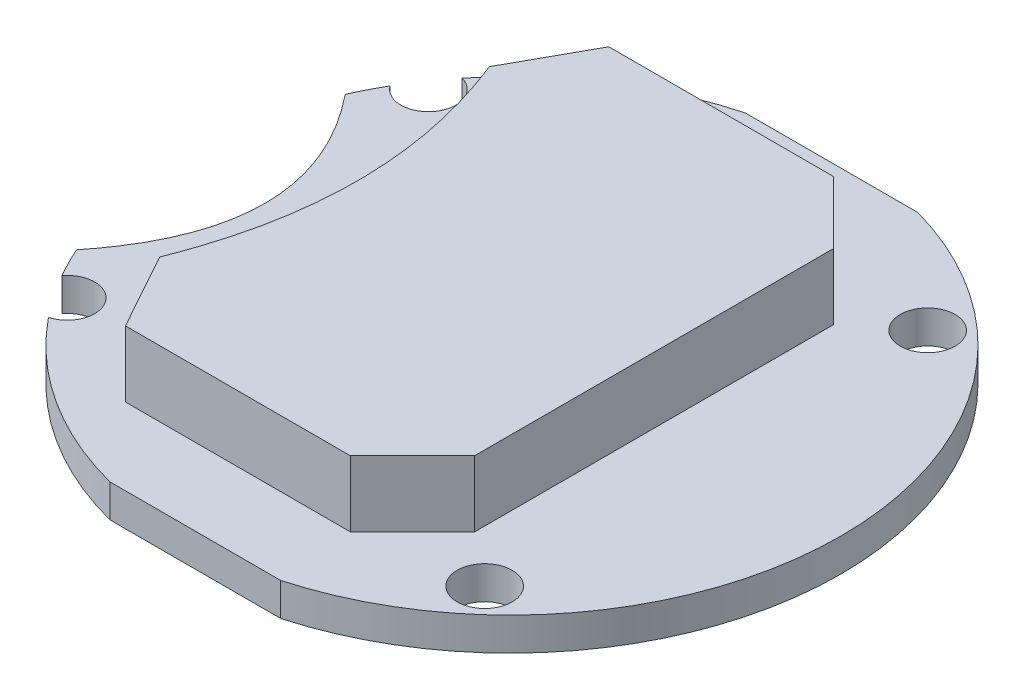
ISO-10303-21;
HEADER;
FILE_DESCRIPTION(('STEP AP214'),'2;1');
FILE_NAME('part.step','',(''),(''),'','','');
FILE_SCHEMA(('AUTOMOTIVE_DESIGN { 1 0 10303 214 1 1 1 1 }'));
ENDSEC;
DATA;
#1=APPLICATION_CONTEXT('core data for automotive mechanical design processes');
#2=APPLICATION_PROTOCOL_DEFINITION('international standard','automotive_design',2000,#1);
#3=PRODUCT_CONTEXT('',#1,'mechanical');
#4=PRODUCT('Part','Part','',(#3));
#5=PRODUCT_RELATED_PRODUCT_CATEGORY('part','',(#4));
#6=PRODUCT_DEFINITION_FORMATION('','',#4);
#7=PRODUCT_DEFINITION_CONTEXT('part definition',#1,'design');
#8=PRODUCT_DEFINITION('design','',#6,#7);
#9=PRODUCT_DEFINITION_SHAPE('','',#8);
#10=(LENGTH_UNIT() NAMED_UNIT(*) SI_UNIT(.MILLI.,.METRE.));
#11=(NAMED_UNIT(*) PLANE_ANGLE_UNIT() SI_UNIT($,.RADIAN.));
#12=(NAMED_UNIT(*) SI_UNIT($,.STERADIAN.) SOLID_ANGLE_UNIT());
#13=UNCERTAINTY_MEASURE_WITH_UNIT(LENGTH_MEASURE(1.E-05),#10,'distance_accuracy_value','');
#14=(GEOMETRIC_REPRESENTATION_CONTEXT(3) GLOBAL_UNCERTAINTY_ASSIGNED_CONTEXT((#13)) GLOBAL_UNIT_ASSIGNED_CONTEXT((#10,
#11,#12)) REPRESENTATION_CONTEXT('',''));
#15=CARTESIAN_POINT('',(0.,0.,0.));
#16=DIRECTION('',(0.,0.,1.));
#17=DIRECTION('',(1.,0.,0.));
#18=AXIS2_PLACEMENT_3D('',#15,#16,#17);
#19=CARTESIAN_POINT('',(-13.,1.5,-6.5));
#20=CARTESIAN_POINT('',(-7.44141836774169,1.5,0.));
#21=CARTESIAN_POINT('',(-13.,1.5,6.5));
#22=B_SPLINE_CURVE_WITH_KNOTS('',2,(#19,#20,#21),.UNSPECIFIED.,.F.,.F.,(3,3),(0.,1.),.UNSPECIFIED.);
#23=DIRECTION('',(0.,-1.,0.));
#24=VECTOR('',#23,1.);
#25=SURFACE_OF_LINEAR_EXTRUSION('',#22,#24);
#26=CARTESIAN_POINT('',(-12.6923999108777,1.5,-6.12975934765053));
#27=VERTEX_POINT('',#26);
#28=CARTESIAN_POINT('',(-12.6783485508095,1.5,6.11231092326812));
#29=VERTEX_POINT('',#28);
#30=EDGE_CURVE('E189',#27,#29,#22,.T.);
#31=ORIENTED_EDGE('',*,*,#30,.F.);
#32=DIRECTION('',(0.,-1.,0.));
#33=VECTOR('',#32,1.);
#34=CARTESIAN_POINT('',(-12.6923999108777,1.5,-6.12975934765053));
#35=LINE('',#34,#33);
#36=CARTESIAN_POINT('',(-12.6923999108777,0.,-6.12975934765053));
#37=VERTEX_POINT('',#36);
#38=EDGE_CURVE('E169',#27,#37,#35,.T.);
#39=ORIENTED_EDGE('',*,*,#38,.T.);
#40=CARTESIAN_POINT('',(-13.,0.,-6.5));
#41=CARTESIAN_POINT('',(-7.44141836774169,0.,0.));
#42=CARTESIAN_POINT('',(-13.,0.,6.5));
#43=B_SPLINE_CURVE_WITH_KNOTS('',2,(#40,#41,#42),.UNSPECIFIED.,.F.,.F.,(3,3),(0.,1.),.UNSPECIFIED.);
#44=CARTESIAN_POINT('',(-12.6783485508095,0.,6.11231092326812));
#45=VERTEX_POINT('',#44);
#46=EDGE_CURVE('E333',#37,#45,#43,.T.);
#47=ORIENTED_EDGE('',*,*,#46,.T.);
#48=DIRECTION('',(0.,-1.,0.));
#49=VECTOR('',#48,1.);
#50=CARTESIAN_POINT('',(-12.6783485508095,1.5,6.11231092326812));
#51=LINE('',#50,#49);
#52=EDGE_CURVE('E223',#45,#29,#51,.F.);
#53=ORIENTED_EDGE('',*,*,#52,.T.);
#54=EDGE_LOOP('',(#31,#39,#47,#53));
#55=FACE_BOUND('',#54,.T.);
#56=ADVANCED_FACE('F36',(#55),#25,.F.);
#57=CARTESIAN_POINT('',(0.,1.5,14.5));
#58=DIRECTION('',(0.,0.,-1.));
#59=DIRECTION('',(-1.,0.,0.));
#60=AXIS2_PLACEMENT_3D('',#57,#58,#59);
#61=PLANE('',#60);
#62=DIRECTION('',(1.,0.,0.));
#63=VECTOR('',#62,1.);
#64=CARTESIAN_POINT('',(0.,1.5,14.5));
#65=LINE('',#64,#63);
#66=CARTESIAN_POINT('',(-2.76393178653415,1.5,14.5));
#67=VERTEX_POINT('',#66);
#68=CARTESIAN_POINT('',(5.00000000000001,1.5,14.5));
#69=VERTEX_POINT('',#68);
#70=EDGE_CURVE('E193',#67,#69,#65,.T.);
#71=ORIENTED_EDGE('',*,*,#70,.F.);
#72=DIRECTION('',(0.,1.,0.));
#73=VECTOR('',#72,1.);
#74=CARTESIAN_POINT('',(-2.76393178653415,0.,14.5));
#75=LINE('',#74,#73);
#76=CARTESIAN_POINT('',(-2.76393178653415,0.,14.5));
#77=VERTEX_POINT('',#76);
#78=EDGE_CURVE('E320',#77,#67,#75,.T.);
#79=ORIENTED_EDGE('',*,*,#78,.F.);
#80=DIRECTION('',(1.,0.,0.));
#81=VECTOR('',#80,1.);
#82=CARTESIAN_POINT('',(0.,0.,14.5));
#83=LINE('',#82,#81);
#84=CARTESIAN_POINT('',(5.00000000000001,0.,14.5));
#85=VERTEX_POINT('',#84);
#86=EDGE_CURVE('E194',#77,#85,#83,.T.);
#87=ORIENTED_EDGE('',*,*,#86,.T.);
#88=DIRECTION('',(0.,-1.,0.));
#89=VECTOR('',#88,1.);
#90=CARTESIAN_POINT('',(5.00000000000001,1.5,14.5));
#91=LINE('',#90,#89);
#92=EDGE_CURVE('E199',#69,#85,#91,.T.);
#93=ORIENTED_EDGE('',*,*,#92,.F.);
#94=EDGE_LOOP('',(#71,#79,#87,#93));
#95=FACE_BOUND('',#94,.T.);
#96=ADVANCED_FACE('F310',(#95),#61,.F.);
#97=CARTESIAN_POINT('',(0.940393926890195,1.5,0.));
#98=DIRECTION('',(0.,-1.,0.));
#99=DIRECTION('',(0.,0.,-1.));
#100=AXIS2_PLACEMENT_3D('',#97,#98,#99);
#101=CYLINDRICAL_SURFACE('',#100,15.0575695737669);
#102=CARTESIAN_POINT('',(0.940393926890195,0.,0.));
#103=DIRECTION('',(0.,1.,0.));
#104=DIRECTION('',(0.,0.,1.));
#105=AXIS2_PLACEMENT_3D('',#102,#103,#104);
#106=CIRCLE('',#105,15.0575695737669);
#107=CARTESIAN_POINT('',(5.,0.,-14.5));
#108=VERTEX_POINT('',#107);
#109=EDGE_CURVE('E190',#108,#85,#106,.F.);
#110=ORIENTED_EDGE('',*,*,#109,.F.);
#111=DIRECTION('',(0.,-1.,0.));
#112=VECTOR('',#111,1.);
#113=CARTESIAN_POINT('',(5.,1.5,-14.5));
#114=LINE('',#113,#112);
#115=CARTESIAN_POINT('',(5.,1.5,-14.5));
#116=VERTEX_POINT('',#115);
#117=EDGE_CURVE('E187',#116,#108,#114,.T.);
#118=ORIENTED_EDGE('',*,*,#117,.F.);
#119=CARTESIAN_POINT('',(0.940393926890195,1.5,0.));
#120=DIRECTION('',(0.,1.,0.));
#121=DIRECTION('',(0.,0.,1.));
#122=AXIS2_PLACEMENT_3D('',#119,#120,#121);
#123=CIRCLE('',#122,15.0575695737669);
#124=EDGE_CURVE('E324',#116,#69,#123,.F.);
#125=ORIENTED_EDGE('',*,*,#124,.T.);
#126=ORIENTED_EDGE('',*,*,#92,.T.);
#127=EDGE_LOOP('',(#110,#118,#125,#126));
#128=FACE_BOUND('',#127,.T.);
#129=ADVANCED_FACE('F308',(#128),#101,.T.);
#130=CARTESIAN_POINT('',(0.,1.5,-14.5));
#131=DIRECTION('',(0.,0.,-1.));
#132=DIRECTION('',(-1.,0.,0.));
#133=AXIS2_PLACEMENT_3D('',#130,#131,#132);
#134=PLANE('',#133);
#135=DIRECTION('',(0.,1.,0.));
#136=VECTOR('',#135,1.);
#137=CARTESIAN_POINT('',(-2.84260937327721,0.,-14.5));
#138=LINE('',#137,#136);
#139=CARTESIAN_POINT('',(-2.84260937327721,0.,-14.5));
#140=VERTEX_POINT('',#139);
#141=CARTESIAN_POINT('',(-2.84260937327721,1.5,-14.5));
#142=VERTEX_POINT('',#141);
#143=EDGE_CURVE('E159',#140,#142,#138,.T.);
#144=ORIENTED_EDGE('',*,*,#143,.T.);
#145=DIRECTION('',(1.,0.,0.));
#146=VECTOR('',#145,1.);
#147=CARTESIAN_POINT('',(0.,1.5,-14.5));
#148=LINE('',#147,#146);
#149=EDGE_CURVE('E200',#142,#116,#148,.T.);
#150=ORIENTED_EDGE('',*,*,#149,.T.);
#151=ORIENTED_EDGE('',*,*,#117,.T.);
#152=DIRECTION('',(1.,0.,0.));
#153=VECTOR('',#152,1.);
#154=CARTESIAN_POINT('',(0.,0.,-14.5));
#155=LINE('',#154,#153);
#156=EDGE_CURVE('E178',#140,#108,#155,.T.);
#157=ORIENTED_EDGE('',*,*,#156,.F.);
#158=EDGE_LOOP('',(#144,#150,#151,#157));
#159=FACE_BOUND('',#158,.T.);
#160=ADVANCED_FACE('F185',(#159),#134,.T.);
#161=CARTESIAN_POINT('',(0.,1.5,0.));
#162=DIRECTION('',(0.,1.,0.));
#163=DIRECTION('',(0.,0.,1.));
#164=AXIS2_PLACEMENT_3D('',#161,#162,#163);
#165=PLANE('',#164);
#166=CARTESIAN_POINT('',(0.997963500657083,1.5,0.));
#167=DIRECTION('',(0.,-1.,0.));
#168=DIRECTION('',(0.,0.,1.));
#169=AXIS2_PLACEMENT_3D('',#166,#167,#168);
#170=CIRCLE('',#169,15.);
#171=CARTESIAN_POINT('',(-12.0049017376976,1.5,-7.47833508163339));
#172=VERTEX_POINT('',#171);
#173=EDGE_CURVE('E183',#27,#172,#170,.T.);
#174=ORIENTED_EDGE('',*,*,#173,.F.);
#175=ORIENTED_EDGE('',*,*,#30,.T.);
#176=CARTESIAN_POINT('',(0.997963500657083,1.5,0.));
#177=DIRECTION('',(0.,-1.,0.));
#178=DIRECTION('',(0.,0.,1.));
#179=AXIS2_PLACEMENT_3D('',#176,#177,#178);
#180=CIRCLE('',#179,14.9800486031185);
#181=CARTESIAN_POINT('',(-11.9918836910147,1.5,7.46094672872067));
#182=VERTEX_POINT('',#181);
#183=EDGE_CURVE('E222',#182,#29,#180,.T.);
#184=ORIENTED_EDGE('',*,*,#183,.F.);
#185=CARTESIAN_POINT('',(-10.9977895143907,1.5,8.21875723801847));
#186=DIRECTION('',(0.,1.,0.));
#187=DIRECTION('',(0.,0.,-1.));
#188=AXIS2_PLACEMENT_3D('',#185,#186,#187);
#189=CIRCLE('',#188,1.25);
#190=CARTESIAN_POINT('',(-10.6500594971999,1.5,9.41941698796618));
#191=VERTEX_POINT('',#190);
#192=EDGE_CURVE('E212',#191,#182,#189,.T.);
#193=ORIENTED_EDGE('',*,*,#192,.F.);
#194=EDGE_CURVE('E51',#67,#191,#180,.T.);
#195=ORIENTED_EDGE('',*,*,#194,.F.);
#196=ORIENTED_EDGE('',*,*,#70,.T.);
#197=ORIENTED_EDGE('',*,*,#124,.F.);
#198=ORIENTED_EDGE('',*,*,#149,.F.);
#199=CARTESIAN_POINT('',(-10.670975333413,1.5,-9.42527805885491));
#200=VERTEX_POINT('',#199);
#201=EDGE_CURVE('E165',#200,#142,#170,.T.);
#202=ORIENTED_EDGE('',*,*,#201,.F.);
#203=CARTESIAN_POINT('',(-10.9977895143907,1.5,-8.21875723801847));
#204=DIRECTION('',(0.,1.,0.));
#205=DIRECTION('',(0.,0.,1.));
#206=AXIS2_PLACEMENT_3D('',#203,#204,#205);
#207=CIRCLE('',#206,1.25);
#208=EDGE_CURVE('E232',#172,#200,#207,.T.);
#209=ORIENTED_EDGE('',*,*,#208,.F.);
#210=EDGE_LOOP('',(#174,#175,#184,#193,#195,#196,#197,#198,#202,#209));
#211=FACE_BOUND('',#210,.T.);
#212=CARTESIAN_POINT('',(9.86311325408307,1.5,10.0810345190209));
#213=DIRECTION('',(0.,1.,0.));
#214=DIRECTION('',(0.,0.,-1.));
#215=AXIS2_PLACEMENT_3D('',#212,#213,#214);
#216=CIRCLE('',#215,1.25);
#217=CARTESIAN_POINT('',(9.86311325408307,1.5,8.83103451902089));
#218=VERTEX_POINT('',#217);
#219=EDGE_CURVE('E225',#218,#218,#216,.T.);
#220=ORIENTED_EDGE('',*,*,#219,.F.);
#221=EDGE_LOOP('',(#220));
#222=FACE_BOUND('',#221,.T.);
#223=CARTESIAN_POINT('',(9.86311325408307,1.5,-10.0810345190209));
#224=DIRECTION('',(0.,1.,0.));
#225=DIRECTION('',(0.,0.,1.));
#226=AXIS2_PLACEMENT_3D('',#223,#224,#225);
#227=CIRCLE('',#226,1.25);
#228=CARTESIAN_POINT('',(9.86311325408307,1.5,-8.83103451902089));
#229=VERTEX_POINT('',#228);
#230=EDGE_CURVE('E231',#229,#229,#227,.T.);
#231=ORIENTED_EDGE('',*,*,#230,.F.);
#232=EDGE_LOOP('',(#231));
#233=FACE_BOUND('',#232,.T.);
#234=DIRECTION('',(1.,0.,0.));
#235=VECTOR('',#234,1.);
#236=CARTESIAN_POINT('',(-5.56612917523306,1.5,11.));
#237=LINE('',#236,#235);
#238=CARTESIAN_POINT('',(-5.56612917523306,1.5,11.));
#239=VERTEX_POINT('',#238);
#240=CARTESIAN_POINT('',(4.66895202691704,1.5,11.));
#241=VERTEX_POINT('',#240);
#242=EDGE_CURVE('E243',#239,#241,#237,.T.);
#243=ORIENTED_EDGE('',*,*,#242,.F.);
#244=DIRECTION('',(0.484122918275927,0.,0.875));
#245=VECTOR('',#244,1.);
#246=CARTESIAN_POINT('',(-7.50262084833677,1.5,7.5));
#247=LINE('',#246,#245);
#248=CARTESIAN_POINT('',(-7.50262084833677,1.5,7.5));
#249=VERTEX_POINT('',#248);
#250=EDGE_CURVE('E250',#249,#239,#247,.T.);
#251=ORIENTED_EDGE('',*,*,#250,.F.);
#252=CARTESIAN_POINT('',(-7.50262084833677,1.5,-7.5));
#253=CARTESIAN_POINT('',(-4.50262084833677,1.5,-6.75131347608533E-12));
#254=CARTESIAN_POINT('',(-7.50262084833677,1.5,7.5));
#255=B_SPLINE_CURVE_WITH_KNOTS('',2,(#252,#253,#254),.UNSPECIFIED.,.F.,.F.,(3,3),(0.,1.),.UNSPECIFIED.);
#256=CARTESIAN_POINT('',(-7.50262084833677,1.5,-7.5));
#257=VERTEX_POINT('',#256);
#258=EDGE_CURVE('E414',#257,#249,#255,.T.);
#259=ORIENTED_EDGE('',*,*,#258,.F.);
#260=DIRECTION('',(-0.484122918275927,0.,0.875));
#261=VECTOR('',#260,1.);
#262=CARTESIAN_POINT('',(-7.50262084833677,1.5,-7.5));
#263=LINE('',#262,#261);
#264=CARTESIAN_POINT('',(-5.56612917523306,1.5,-11.));
#265=VERTEX_POINT('',#264);
#266=EDGE_CURVE('E419',#265,#257,#263,.T.);
#267=ORIENTED_EDGE('',*,*,#266,.F.);
#268=DIRECTION('',(-1.,0.,0.));
#269=VECTOR('',#268,1.);
#270=CARTESIAN_POINT('',(-5.56612917523306,1.5,-11.));
#271=LINE('',#270,#269);
#272=CARTESIAN_POINT('',(4.66895202691704,1.5,-11.));
#273=VERTEX_POINT('',#272);
#274=EDGE_CURVE('E425',#273,#265,#271,.T.);
#275=ORIENTED_EDGE('',*,*,#274,.F.);
#276=DIRECTION('',(-0.707106781186546,0.,-0.707106781186549));
#277=VECTOR('',#276,1.);
#278=CARTESIAN_POINT('',(4.66895202691704,1.5,-11.));
#279=LINE('',#278,#277);
#280=CARTESIAN_POINT('',(7.49737915166323,1.5,-8.1715728752538));
#281=VERTEX_POINT('',#280);
#282=EDGE_CURVE('E428',#281,#273,#279,.T.);
#283=ORIENTED_EDGE('',*,*,#282,.F.);
#284=DIRECTION('',(0.,0.,-1.));
#285=VECTOR('',#284,1.);
#286=CARTESIAN_POINT('',(7.49737915166323,1.5,-8.1715728752538));
#287=LINE('',#286,#285);
#288=CARTESIAN_POINT('',(7.49737915166323,1.5,8.1715728752538));
#289=VERTEX_POINT('',#288);
#290=EDGE_CURVE('E431',#289,#281,#287,.T.);
#291=ORIENTED_EDGE('',*,*,#290,.F.);
#292=DIRECTION('',(0.707106781186546,0.,-0.707106781186549));
#293=VECTOR('',#292,1.);
#294=CARTESIAN_POINT('',(4.66895202691704,1.5,11.));
#295=LINE('',#294,#293);
#296=EDGE_CURVE('E434',#241,#289,#295,.T.);
#297=ORIENTED_EDGE('',*,*,#296,.F.);
#298=EDGE_LOOP('',(#243,#251,#259,#267,#275,#283,#291,#297));
#299=FACE_BOUND('',#298,.T.);
#300=ADVANCED_FACE('F219',(#211,#222,#233,#299),#165,.T.);
#301=CARTESIAN_POINT('',(0.,0.,0.));
#302=DIRECTION('',(0.,1.,0.));
#303=DIRECTION('',(0.,0.,1.));
#304=AXIS2_PLACEMENT_3D('',#301,#302,#303);
#305=PLANE('',#304);
#306=ORIENTED_EDGE('',*,*,#46,.F.);
#307=CARTESIAN_POINT('',(0.997963500657083,0.,0.));
#308=DIRECTION('',(0.,-1.,0.));
#309=DIRECTION('',(0.,0.,1.));
#310=AXIS2_PLACEMENT_3D('',#307,#308,#309);
#311=CIRCLE('',#310,15.);
#312=CARTESIAN_POINT('',(-12.0049017376976,0.,-7.4783350816334));
#313=VERTEX_POINT('',#312);
#314=EDGE_CURVE('E170',#37,#313,#311,.T.);
#315=ORIENTED_EDGE('',*,*,#314,.T.);
#316=CARTESIAN_POINT('',(-10.9977895143907,0.,-8.21875723801847));
#317=DIRECTION('',(0.,1.,0.));
#318=DIRECTION('',(0.,0.,1.));
#319=AXIS2_PLACEMENT_3D('',#316,#317,#318);
#320=CIRCLE('',#319,1.25);
#321=CARTESIAN_POINT('',(-10.670975333413,0.,-9.42527805885492));
#322=VERTEX_POINT('',#321);
#323=EDGE_CURVE('E182',#313,#322,#320,.T.);
#324=ORIENTED_EDGE('',*,*,#323,.T.);
#325=EDGE_CURVE('E162',#322,#140,#311,.T.);
#326=ORIENTED_EDGE('',*,*,#325,.T.);
#327=ORIENTED_EDGE('',*,*,#156,.T.);
#328=ORIENTED_EDGE('',*,*,#109,.T.);
#329=ORIENTED_EDGE('',*,*,#86,.F.);
#330=CARTESIAN_POINT('',(0.997963500657083,0.,0.));
#331=DIRECTION('',(0.,-1.,0.));
#332=DIRECTION('',(0.,0.,1.));
#333=AXIS2_PLACEMENT_3D('',#330,#331,#332);
#334=CIRCLE('',#333,14.9800486031185);
#335=CARTESIAN_POINT('',(-10.6500594971999,0.,9.41941698796617));
#336=VERTEX_POINT('',#335);
#337=EDGE_CURVE('E349',#77,#336,#334,.T.);
#338=ORIENTED_EDGE('',*,*,#337,.T.);
#339=CARTESIAN_POINT('',(-10.9977895143907,0.,8.21875723801847));
#340=DIRECTION('',(0.,1.,0.));
#341=DIRECTION('',(0.,0.,-1.));
#342=AXIS2_PLACEMENT_3D('',#339,#340,#341);
#343=CIRCLE('',#342,1.25);
#344=CARTESIAN_POINT('',(-11.9918836910147,0.,7.46094672872067));
#345=VERTEX_POINT('',#344);
#346=EDGE_CURVE('E214',#336,#345,#343,.T.);
#347=ORIENTED_EDGE('',*,*,#346,.T.);
#348=EDGE_CURVE('E59',#345,#45,#334,.T.);
#349=ORIENTED_EDGE('',*,*,#348,.T.);
#350=EDGE_LOOP('',(#306,#315,#324,#326,#327,#328,#329,#338,#347,#349));
#351=FACE_BOUND('',#350,.T.);
#352=CARTESIAN_POINT('',(9.86311325408307,0.,10.0810345190209));
#353=DIRECTION('',(0.,1.,0.));
#354=DIRECTION('',(0.,0.,-1.));
#355=AXIS2_PLACEMENT_3D('',#352,#353,#354);
#356=CIRCLE('',#355,1.25);
#357=CARTESIAN_POINT('',(9.86311325408307,0.,8.83103451902089));
#358=VERTEX_POINT('',#357);
#359=EDGE_CURVE('E235',#358,#358,#356,.T.);
#360=ORIENTED_EDGE('',*,*,#359,.T.);
#361=EDGE_LOOP('',(#360));
#362=FACE_BOUND('',#361,.T.);
#363=CARTESIAN_POINT('',(9.86311325408307,0.,-10.0810345190209));
#364=DIRECTION('',(0.,1.,0.));
#365=DIRECTION('',(0.,0.,1.));
#366=AXIS2_PLACEMENT_3D('',#363,#364,#365);
#367=CIRCLE('',#366,1.25);
#368=CARTESIAN_POINT('',(9.86311325408307,0.,-8.83103451902089));
#369=VERTEX_POINT('',#368);
#370=EDGE_CURVE('E240',#369,#369,#367,.T.);
#371=ORIENTED_EDGE('',*,*,#370,.T.);
#372=EDGE_LOOP('',(#371));
#373=FACE_BOUND('',#372,.T.);
#374=ADVANCED_FACE('F175',(#351,#362,#373),#305,.F.);
#375=CARTESIAN_POINT('',(-5.56612917523306,4.5,11.));
#376=DIRECTION('',(0.,0.,-1.));
#377=DIRECTION('',(-1.,0.,0.));
#378=AXIS2_PLACEMENT_3D('',#375,#376,#377);
#379=PLANE('',#378);
#380=ORIENTED_EDGE('',*,*,#242,.T.);
#381=DIRECTION('',(0.,-1.,0.));
#382=VECTOR('',#381,1.);
#383=CARTESIAN_POINT('',(4.66895202691704,4.5,11.));
#384=LINE('',#383,#382);
#385=CARTESIAN_POINT('',(4.66895202691704,4.5,11.));
#386=VERTEX_POINT('',#385);
#387=EDGE_CURVE('E337',#386,#241,#384,.T.);
#388=ORIENTED_EDGE('',*,*,#387,.F.);
#389=DIRECTION('',(1.,0.,0.));
#390=VECTOR('',#389,1.);
#391=CARTESIAN_POINT('',(-5.56612917523306,4.5,11.));
#392=LINE('',#391,#390);
#393=CARTESIAN_POINT('',(-5.56612917523306,4.5,11.));
#394=VERTEX_POINT('',#393);
#395=EDGE_CURVE('E246',#394,#386,#392,.T.);
#396=ORIENTED_EDGE('',*,*,#395,.F.);
#397=DIRECTION('',(0.,-1.,0.));
#398=VECTOR('',#397,1.);
#399=CARTESIAN_POINT('',(-5.56612917523306,4.5,11.));
#400=LINE('',#399,#398);
#401=EDGE_CURVE('E410',#394,#239,#400,.T.);
#402=ORIENTED_EDGE('',*,*,#401,.T.);
#403=EDGE_LOOP('',(#380,#388,#396,#402));
#404=FACE_BOUND('',#403,.T.);
#405=ADVANCED_FACE('F297',(#404),#379,.F.);
#406=CARTESIAN_POINT('',(4.66895202691704,4.5,11.));
#407=DIRECTION('',(-0.707106781186549,0.,-0.707106781186546));
#408=DIRECTION('',(-0.707106781186546,0.,0.707106781186549));
#409=AXIS2_PLACEMENT_3D('',#406,#407,#408);
#410=PLANE('',#409);
#411=ORIENTED_EDGE('',*,*,#296,.T.);
#412=DIRECTION('',(0.,-1.,0.));
#413=VECTOR('',#412,1.);
#414=CARTESIAN_POINT('',(7.49737915166323,4.5,8.1715728752538));
#415=LINE('',#414,#413);
#416=CARTESIAN_POINT('',(7.49737915166323,4.5,8.1715728752538));
#417=VERTEX_POINT('',#416);
#418=EDGE_CURVE('E391',#417,#289,#415,.T.);
#419=ORIENTED_EDGE('',*,*,#418,.F.);
#420=DIRECTION('',(0.707106781186546,0.,-0.707106781186549));
#421=VECTOR('',#420,1.);
#422=CARTESIAN_POINT('',(4.66895202691704,4.5,11.));
#423=LINE('',#422,#421);
#424=EDGE_CURVE('E249',#386,#417,#423,.T.);
#425=ORIENTED_EDGE('',*,*,#424,.F.);
#426=ORIENTED_EDGE('',*,*,#387,.T.);
#427=EDGE_LOOP('',(#411,#419,#425,#426));
#428=FACE_BOUND('',#427,.T.);
#429=ADVANCED_FACE('F293',(#428),#410,.F.);
#430=CARTESIAN_POINT('',(7.49737915166323,4.5,-8.1715728752538));
#431=DIRECTION('',(-1.,0.,0.));
#432=DIRECTION('',(0.,0.,1.));
#433=AXIS2_PLACEMENT_3D('',#430,#431,#432);
#434=PLANE('',#433);
#435=ORIENTED_EDGE('',*,*,#290,.T.);
#436=DIRECTION('',(0.,-1.,0.));
#437=VECTOR('',#436,1.);
#438=CARTESIAN_POINT('',(7.49737915166323,4.5,-8.1715728752538));
#439=LINE('',#438,#437);
#440=CARTESIAN_POINT('',(7.49737915166323,4.5,-8.1715728752538));
#441=VERTEX_POINT('',#440);
#442=EDGE_CURVE('E393',#441,#281,#439,.T.);
#443=ORIENTED_EDGE('',*,*,#442,.F.);
#444=DIRECTION('',(0.,0.,-1.));
#445=VECTOR('',#444,1.);
#446=CARTESIAN_POINT('',(7.49737915166323,4.5,-8.1715728752538));
#447=LINE('',#446,#445);
#448=EDGE_CURVE('E252',#417,#441,#447,.T.);
#449=ORIENTED_EDGE('',*,*,#448,.F.);
#450=ORIENTED_EDGE('',*,*,#418,.T.);
#451=EDGE_LOOP('',(#435,#443,#449,#450));
#452=FACE_BOUND('',#451,.T.);
#453=ADVANCED_FACE('F289',(#452),#434,.F.);
#454=CARTESIAN_POINT('',(4.66895202691704,4.5,-11.));
#455=DIRECTION('',(-0.707106781186549,0.,0.707106781186546));
#456=DIRECTION('',(0.707106781186546,0.,0.707106781186549));
#457=AXIS2_PLACEMENT_3D('',#454,#455,#456);
#458=PLANE('',#457);
#459=ORIENTED_EDGE('',*,*,#282,.T.);
#460=DIRECTION('',(0.,-1.,0.));
#461=VECTOR('',#460,1.);
#462=CARTESIAN_POINT('',(4.66895202691704,4.5,-11.));
#463=LINE('',#462,#461);
#464=CARTESIAN_POINT('',(4.66895202691704,4.5,-11.));
#465=VERTEX_POINT('',#464);
#466=EDGE_CURVE('E398',#465,#273,#463,.T.);
#467=ORIENTED_EDGE('',*,*,#466,.F.);
#468=DIRECTION('',(-0.707106781186546,0.,-0.707106781186549));
#469=VECTOR('',#468,1.);
#470=CARTESIAN_POINT('',(4.66895202691704,4.5,-11.));
#471=LINE('',#470,#469);
#472=EDGE_CURVE('E254',#441,#465,#471,.T.);
#473=ORIENTED_EDGE('',*,*,#472,.F.);
#474=ORIENTED_EDGE('',*,*,#442,.T.);
#475=EDGE_LOOP('',(#459,#467,#473,#474));
#476=FACE_BOUND('',#475,.T.);
#477=ADVANCED_FACE('F285',(#476),#458,.F.);
#478=CARTESIAN_POINT('',(-5.56612917523306,4.5,-11.));
#479=DIRECTION('',(0.,0.,1.));
#480=DIRECTION('',(1.,0.,0.));
#481=AXIS2_PLACEMENT_3D('',#478,#479,#480);
#482=PLANE('',#481);
#483=ORIENTED_EDGE('',*,*,#274,.T.);
#484=DIRECTION('',(0.,-1.,0.));
#485=VECTOR('',#484,1.);
#486=CARTESIAN_POINT('',(-5.56612917523306,4.5,-11.));
#487=LINE('',#486,#485);
#488=CARTESIAN_POINT('',(-5.56612917523306,4.5,-11.));
#489=VERTEX_POINT('',#488);
#490=EDGE_CURVE('E401',#489,#265,#487,.T.);
#491=ORIENTED_EDGE('',*,*,#490,.F.);
#492=DIRECTION('',(-1.,0.,0.));
#493=VECTOR('',#492,1.);
#494=CARTESIAN_POINT('',(-5.56612917523306,4.5,-11.));
#495=LINE('',#494,#493);
#496=EDGE_CURVE('E256',#465,#489,#495,.T.);
#497=ORIENTED_EDGE('',*,*,#496,.F.);
#498=ORIENTED_EDGE('',*,*,#466,.T.);
#499=EDGE_LOOP('',(#483,#491,#497,#498));
#500=FACE_BOUND('',#499,.T.);
#501=ADVANCED_FACE('F281',(#500),#482,.F.);
#502=CARTESIAN_POINT('',(-7.50262084833677,4.5,-7.5));
#503=DIRECTION('',(0.875,0.,0.484122918275928));
#504=DIRECTION('',(0.484122918275928,0.,-0.875));
#505=AXIS2_PLACEMENT_3D('',#502,#503,#504);
#506=PLANE('',#505);
#507=ORIENTED_EDGE('',*,*,#266,.T.);
#508=DIRECTION('',(0.,-1.,0.));
#509=VECTOR('',#508,1.);
#510=CARTESIAN_POINT('',(-7.50262084833677,4.5,-7.5));
#511=LINE('',#510,#509);
#512=CARTESIAN_POINT('',(-7.50262084833677,4.5,-7.5));
#513=VERTEX_POINT('',#512);
#514=EDGE_CURVE('E404',#513,#257,#511,.T.);
#515=ORIENTED_EDGE('',*,*,#514,.F.);
#516=DIRECTION('',(-0.484122918275927,0.,0.875));
#517=VECTOR('',#516,1.);
#518=CARTESIAN_POINT('',(-7.50262084833677,4.5,-7.5));
#519=LINE('',#518,#517);
#520=EDGE_CURVE('E258',#489,#513,#519,.T.);
#521=ORIENTED_EDGE('',*,*,#520,.F.);
#522=ORIENTED_EDGE('',*,*,#490,.T.);
#523=EDGE_LOOP('',(#507,#515,#521,#522));
#524=FACE_BOUND('',#523,.T.);
#525=ADVANCED_FACE('F276',(#524),#506,.F.);
#526=CARTESIAN_POINT('',(-7.50262084833677,4.5,-7.5));
#527=CARTESIAN_POINT('',(-4.50262084833677,4.5,-6.75131347608533E-12));
#528=CARTESIAN_POINT('',(-7.50262084833677,4.5,7.5));
#529=B_SPLINE_CURVE_WITH_KNOTS('',2,(#526,#527,#528),.UNSPECIFIED.,.F.,.F.,(3,3),(0.,1.),.UNSPECIFIED.);
#530=DIRECTION('',(0.,-1.,0.));
#531=VECTOR('',#530,1.);
#532=SURFACE_OF_LINEAR_EXTRUSION('',#529,#531);
#533=ORIENTED_EDGE('',*,*,#258,.T.);
#534=DIRECTION('',(0.,-1.,0.));
#535=VECTOR('',#534,1.);
#536=CARTESIAN_POINT('',(-7.50262084833677,4.5,7.5));
#537=LINE('',#536,#535);
#538=CARTESIAN_POINT('',(-7.50262084833677,4.5,7.5));
#539=VERTEX_POINT('',#538);
#540=EDGE_CURVE('E407',#539,#249,#537,.T.);
#541=ORIENTED_EDGE('',*,*,#540,.F.);
#542=EDGE_CURVE('E260',#513,#539,#529,.T.);
#543=ORIENTED_EDGE('',*,*,#542,.F.);
#544=ORIENTED_EDGE('',*,*,#514,.T.);
#545=EDGE_LOOP('',(#533,#541,#543,#544));
#546=FACE_BOUND('',#545,.T.);
#547=ADVANCED_FACE('F271',(#546),#532,.F.);
#548=CARTESIAN_POINT('',(-7.50262084833677,4.5,7.5));
#549=DIRECTION('',(0.875,0.,-0.484122918275928));
#550=DIRECTION('',(-0.484122918275928,0.,-0.875));
#551=AXIS2_PLACEMENT_3D('',#548,#549,#550);
#552=PLANE('',#551);
#553=ORIENTED_EDGE('',*,*,#250,.T.);
#554=ORIENTED_EDGE('',*,*,#401,.F.);
#555=DIRECTION('',(0.484122918275927,0.,0.875));
#556=VECTOR('',#555,1.);
#557=CARTESIAN_POINT('',(-7.50262084833677,4.5,7.5));
#558=LINE('',#557,#556);
#559=EDGE_CURVE('E265',#539,#394,#558,.T.);
#560=ORIENTED_EDGE('',*,*,#559,.F.);
#561=ORIENTED_EDGE('',*,*,#540,.T.);
#562=EDGE_LOOP('',(#553,#554,#560,#561));
#563=FACE_BOUND('',#562,.T.);
#564=ADVANCED_FACE('F275',(#563),#552,.F.);
#565=CARTESIAN_POINT('',(-6.00262084833677,4.5,-3.37577188425087E-12));
#566=DIRECTION('',(0.,1.,0.));
#567=DIRECTION('',(0.,0.,1.));
#568=AXIS2_PLACEMENT_3D('',#565,#566,#567);
#569=PLANE('',#568);
#570=ORIENTED_EDGE('',*,*,#395,.T.);
#571=ORIENTED_EDGE('',*,*,#424,.T.);
#572=ORIENTED_EDGE('',*,*,#448,.T.);
#573=ORIENTED_EDGE('',*,*,#472,.T.);
#574=ORIENTED_EDGE('',*,*,#496,.T.);
#575=ORIENTED_EDGE('',*,*,#520,.T.);
#576=ORIENTED_EDGE('',*,*,#542,.T.);
#577=ORIENTED_EDGE('',*,*,#559,.T.);
#578=EDGE_LOOP('',(#570,#571,#572,#573,#574,#575,#576,#577));
#579=FACE_BOUND('',#578,.T.);
#580=ADVANCED_FACE('F374',(#579),#569,.T.);
#581=CARTESIAN_POINT('',(9.86311325408307,0.,-10.0810345190209));
#582=DIRECTION('',(0.,1.,0.));
#583=DIRECTION('',(0.,0.,1.));
#584=AXIS2_PLACEMENT_3D('',#581,#582,#583);
#585=CYLINDRICAL_SURFACE('',#584,1.25);
#586=ORIENTED_EDGE('',*,*,#370,.F.);
#587=EDGE_LOOP('',(#586));
#588=FACE_BOUND('',#587,.T.);
#589=ORIENTED_EDGE('',*,*,#230,.T.);
#590=EDGE_LOOP('',(#589));
#591=FACE_BOUND('',#590,.T.);
#592=ADVANCED_FACE('F367',(#588,#591),#585,.F.);
#593=CARTESIAN_POINT('',(-10.9977895143907,0.,8.21875723801847));
#594=DIRECTION('',(0.,1.,0.));
#595=DIRECTION('',(0.,0.,1.));
#596=AXIS2_PLACEMENT_3D('',#593,#594,#595);
#597=CYLINDRICAL_SURFACE('',#596,1.25);
#598=ORIENTED_EDGE('',*,*,#192,.T.);
#599=DIRECTION('',(0.,1.,0.));
#600=VECTOR('',#599,1.);
#601=CARTESIAN_POINT('',(-11.9918836910147,0.75,7.46094672872066));
#602=LINE('',#601,#600);
#603=EDGE_CURVE('E11',#182,#345,#602,.F.);
#604=ORIENTED_EDGE('',*,*,#603,.T.);
#605=ORIENTED_EDGE('',*,*,#346,.F.);
#606=DIRECTION('',(0.,1.,0.));
#607=VECTOR('',#606,1.);
#608=CARTESIAN_POINT('',(-10.6500594971999,0.75,9.41941698796618));
#609=LINE('',#608,#607);
#610=EDGE_CURVE('E44',#336,#191,#609,.T.);
#611=ORIENTED_EDGE('',*,*,#610,.T.);
#612=EDGE_LOOP('',(#598,#604,#605,#611));
#613=FACE_BOUND('',#612,.T.);
#614=ADVANCED_FACE('F211',(#613),#597,.F.);
#615=CARTESIAN_POINT('',(9.86311325408307,0.,10.0810345190209));
#616=DIRECTION('',(0.,1.,0.));
#617=DIRECTION('',(0.,0.,1.));
#618=AXIS2_PLACEMENT_3D('',#615,#616,#617);
#619=CYLINDRICAL_SURFACE('',#618,1.25);
#620=ORIENTED_EDGE('',*,*,#359,.F.);
#621=EDGE_LOOP('',(#620));
#622=FACE_BOUND('',#621,.T.);
#623=ORIENTED_EDGE('',*,*,#219,.T.);
#624=EDGE_LOOP('',(#623));
#625=FACE_BOUND('',#624,.T.);
#626=ADVANCED_FACE('F366',(#622,#625),#619,.F.);
#627=CARTESIAN_POINT('',(-10.9977895143907,0.,-8.21875723801847));
#628=DIRECTION('',(0.,1.,0.));
#629=DIRECTION('',(0.,0.,1.));
#630=AXIS2_PLACEMENT_3D('',#627,#628,#629);
#631=CYLINDRICAL_SURFACE('',#630,1.25);
#632=ORIENTED_EDGE('',*,*,#208,.T.);
#633=DIRECTION('',(0.,1.,0.));
#634=VECTOR('',#633,1.);
#635=CARTESIAN_POINT('',(-10.670975333413,0.75,-9.42527805885492));
#636=LINE('',#635,#634);
#637=EDGE_CURVE('E206',#200,#322,#636,.F.);
#638=ORIENTED_EDGE('',*,*,#637,.T.);
#639=ORIENTED_EDGE('',*,*,#323,.F.);
#640=DIRECTION('',(0.,1.,0.));
#641=VECTOR('',#640,1.);
#642=CARTESIAN_POINT('',(-12.0049017376976,0.75,-7.47833508163339));
#643=LINE('',#642,#641);
#644=EDGE_CURVE('E203',#313,#172,#643,.T.);
#645=ORIENTED_EDGE('',*,*,#644,.T.);
#646=EDGE_LOOP('',(#632,#638,#639,#645));
#647=FACE_BOUND('',#646,.T.);
#648=ADVANCED_FACE('F344',(#647),#631,.F.);
#649=CARTESIAN_POINT('',(0.997963500657083,0.,0.));
#650=DIRECTION('',(0.,1.,0.));
#651=DIRECTION('',(0.,0.,1.));
#652=AXIS2_PLACEMENT_3D('',#649,#650,#651);
#653=CYLINDRICAL_SURFACE('',#652,15.);
#654=ORIENTED_EDGE('',*,*,#173,.T.);
#655=ORIENTED_EDGE('',*,*,#644,.F.);
#656=ORIENTED_EDGE('',*,*,#314,.F.);
#657=ORIENTED_EDGE('',*,*,#38,.F.);
#658=EDGE_LOOP('',(#654,#655,#656,#657));
#659=FACE_BOUND('',#658,.T.);
#660=ADVANCED_FACE('F346',(#659),#653,.T.);
#661=ORIENTED_EDGE('',*,*,#201,.T.);
#662=ORIENTED_EDGE('',*,*,#143,.F.);
#663=ORIENTED_EDGE('',*,*,#325,.F.);
#664=ORIENTED_EDGE('',*,*,#637,.F.);
#665=EDGE_LOOP('',(#661,#662,#663,#664));
#666=FACE_BOUND('',#665,.T.);
#667=ADVANCED_FACE('F161',(#666),#653,.T.);
#668=CARTESIAN_POINT('',(0.997963500657083,0.,0.));
#669=DIRECTION('',(0.,1.,0.));
#670=DIRECTION('',(0.,0.,1.));
#671=AXIS2_PLACEMENT_3D('',#668,#669,#670);
#672=CYLINDRICAL_SURFACE('',#671,14.9800486031185);
#673=ORIENTED_EDGE('',*,*,#337,.F.);
#674=ORIENTED_EDGE('',*,*,#78,.T.);
#675=ORIENTED_EDGE('',*,*,#194,.T.);
#676=ORIENTED_EDGE('',*,*,#610,.F.);
#677=EDGE_LOOP('',(#673,#674,#675,#676));
#678=FACE_BOUND('',#677,.T.);
#679=ADVANCED_FACE('F355',(#678),#672,.T.);
#680=ORIENTED_EDGE('',*,*,#348,.F.);
#681=ORIENTED_EDGE('',*,*,#603,.F.);
#682=ORIENTED_EDGE('',*,*,#183,.T.);
#683=ORIENTED_EDGE('',*,*,#52,.F.);
#684=EDGE_LOOP('',(#680,#681,#682,#683));
#685=FACE_BOUND('',#684,.T.);
#686=ADVANCED_FACE('F354',(#685),#672,.T.);
#687=CLOSED_SHELL('',(#56,#96,#129,#160,#300,#374,#405,#429,#453,#477,#501,#525,#547,#564,#580,
#592,#614,#626,#648,#660,#667,#679,#686));
#688=MANIFOLD_SOLID_BREP('B2',#687);
#689=ADVANCED_BREP_SHAPE_REPRESENTATION('',(#18,#688),#14);
#690=SHAPE_DEFINITION_REPRESENTATION(#9,#689);
ENDSEC;
END-ISO-10303-21;
